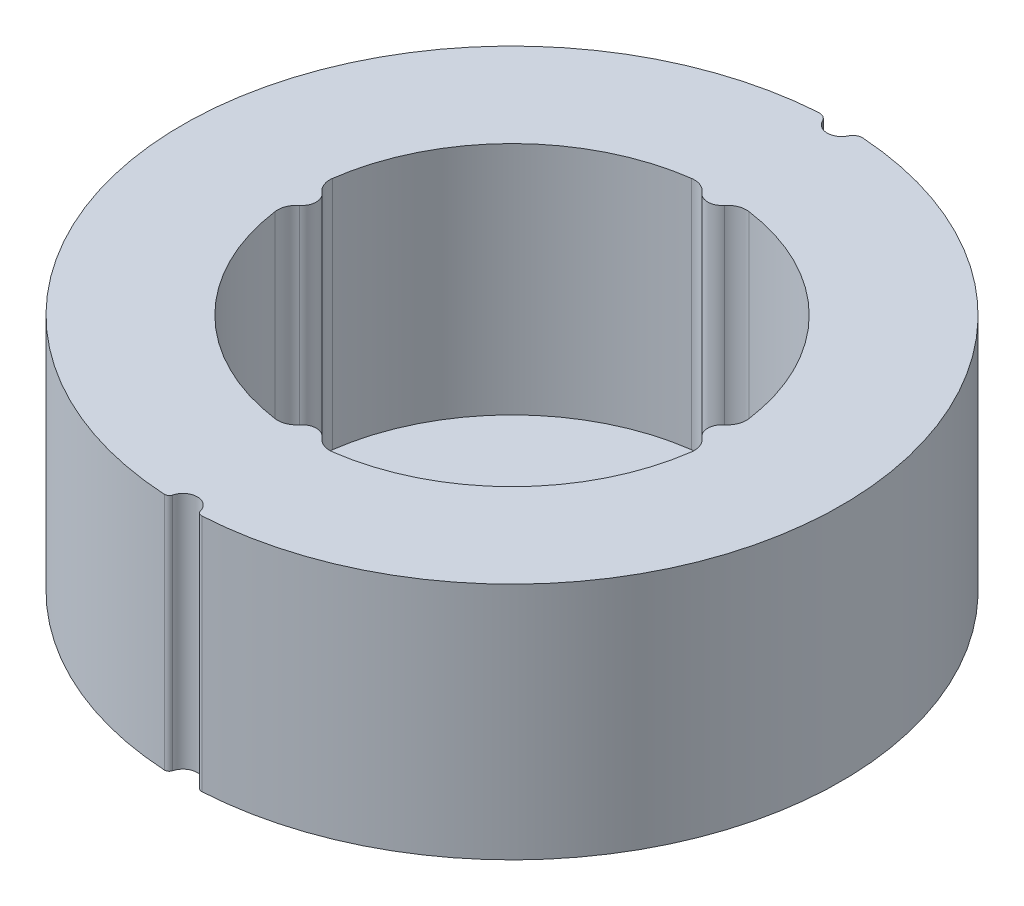
ISO-10303-21;
HEADER;
FILE_DESCRIPTION(('STEP AP214'),'2;1');
FILE_NAME('part.step','',(''),(''),'','','');
FILE_SCHEMA(('AUTOMOTIVE_DESIGN { 1 0 10303 214 1 1 1 1 }'));
ENDSEC;
DATA;
#1=APPLICATION_CONTEXT('core data for automotive mechanical design processes');
#2=APPLICATION_PROTOCOL_DEFINITION('international standard','automotive_design',2000,#1);
#3=PRODUCT_CONTEXT('',#1,'mechanical');
#4=PRODUCT('Part','Part','',(#3));
#5=PRODUCT_RELATED_PRODUCT_CATEGORY('part','',(#4));
#6=PRODUCT_DEFINITION_FORMATION('','',#4);
#7=PRODUCT_DEFINITION_CONTEXT('part definition',#1,'design');
#8=PRODUCT_DEFINITION('design','',#6,#7);
#9=PRODUCT_DEFINITION_SHAPE('','',#8);
#10=(LENGTH_UNIT() NAMED_UNIT(*) SI_UNIT(.MILLI.,.METRE.));
#11=(NAMED_UNIT(*) PLANE_ANGLE_UNIT() SI_UNIT($,.RADIAN.));
#12=(NAMED_UNIT(*) SI_UNIT($,.STERADIAN.) SOLID_ANGLE_UNIT());
#13=UNCERTAINTY_MEASURE_WITH_UNIT(LENGTH_MEASURE(1.E-05),#10,'distance_accuracy_value','');
#14=(GEOMETRIC_REPRESENTATION_CONTEXT(3) GLOBAL_UNCERTAINTY_ASSIGNED_CONTEXT((#13)) GLOBAL_UNIT_ASSIGNED_CONTEXT((#10,
#11,#12)) REPRESENTATION_CONTEXT('',''));
#15=CARTESIAN_POINT('',(0.,0.,0.));
#16=DIRECTION('',(0.,0.,1.));
#17=DIRECTION('',(1.,0.,0.));
#18=AXIS2_PLACEMENT_3D('',#15,#16,#17);
#19=CARTESIAN_POINT('',(0.,25.,0.));
#20=DIRECTION('',(0.,1.,0.));
#21=DIRECTION('',(0.,0.,1.));
#22=AXIS2_PLACEMENT_3D('',#19,#20,#21);
#23=PLANE('',#22);
#24=CARTESIAN_POINT('',(-1.93575856721061,25.,33.9428491683965));
#25=DIRECTION('',(0.,1.,0.));
#26=DIRECTION('',(0.,0.,1.));
#27=AXIS2_PLACEMENT_3D('',#24,#25,#26);
#28=CIRCLE('',#27,0.500000000000003);
#29=CARTESIAN_POINT('',(-1.45181892540796,25.,34.0685568574689));
#30=VERTEX_POINT('',#29);
#31=CARTESIAN_POINT('',(-1.96422560496371,25.,34.4420381383884));
#32=VERTEX_POINT('',#31);
#33=EDGE_CURVE('E338',#30,#32,#28,.F.);
#34=ORIENTED_EDGE('',*,*,#33,.F.);
#35=CARTESIAN_POINT('',(0.,25.,34.4456799246862));
#36=DIRECTION('',(0.,1.,0.));
#37=DIRECTION('',(0.,0.,1.));
#38=AXIS2_PLACEMENT_3D('',#35,#36,#37);
#39=CIRCLE('',#38,1.50000000000002);
#40=CARTESIAN_POINT('',(1.45181892540796,25.,34.0685568574689));
#41=VERTEX_POINT('',#40);
#42=EDGE_CURVE('E342',#41,#30,#39,.T.);
#43=ORIENTED_EDGE('',*,*,#42,.F.);
#44=CARTESIAN_POINT('',(1.93575856721061,25.,33.9428491683965));
#45=DIRECTION('',(0.,1.,0.));
#46=DIRECTION('',(0.,0.,1.));
#47=AXIS2_PLACEMENT_3D('',#44,#45,#46);
#48=CIRCLE('',#47,0.500000000000003);
#49=CARTESIAN_POINT('',(1.9642256049637,25.,34.4420381383884));
#50=VERTEX_POINT('',#49);
#51=EDGE_CURVE('E347',#41,#50,#48,.T.);
#52=ORIENTED_EDGE('',*,*,#51,.T.);
#53=CARTESIAN_POINT('',(0.,25.,-0.0020007910519898));
#54=DIRECTION('',(0.,1.,0.));
#55=DIRECTION('',(0.,0.,1.));
#56=AXIS2_PLACEMENT_3D('',#53,#54,#55);
#57=CIRCLE('',#56,34.5);
#58=CARTESIAN_POINT('',(2.32413582105506,25.,-34.4236276074198));
#59=VERTEX_POINT('',#58);
#60=EDGE_CURVE('E350',#50,#59,#57,.T.);
#61=ORIENTED_EDGE('',*,*,#60,.T.);
#62=CARTESIAN_POINT('',(2.2567695653723,25.,-33.4258992939019));
#63=DIRECTION('',(0.,1.,0.));
#64=DIRECTION('',(0.,0.,1.));
#65=AXIS2_PLACEMENT_3D('',#62,#63,#64);
#66=CIRCLE('',#65,1.);
#67=CARTESIAN_POINT('',(1.35406173922335,25.,-33.8561533823304));
#68=VERTEX_POINT('',#67);
#69=EDGE_CURVE('E353',#68,#59,#66,.F.);
#70=ORIENTED_EDGE('',*,*,#69,.F.);
#71=CARTESIAN_POINT('',(0.,25.,-34.5015345149731));
#72=DIRECTION('',(0.,1.,0.));
#73=DIRECTION('',(0.,0.,1.));
#74=AXIS2_PLACEMENT_3D('',#71,#72,#73);
#75=CIRCLE('',#74,1.49999999999991);
#76=CARTESIAN_POINT('',(-1.35406173922335,25.,-33.8561533823304));
#77=VERTEX_POINT('',#76);
#78=EDGE_CURVE('E357',#77,#68,#75,.T.);
#79=ORIENTED_EDGE('',*,*,#78,.F.);
#80=CARTESIAN_POINT('',(-2.2567695653723,25.,-33.4258992939019));
#81=DIRECTION('',(0.,1.,0.));
#82=DIRECTION('',(0.,0.,1.));
#83=AXIS2_PLACEMENT_3D('',#80,#81,#82);
#84=CIRCLE('',#83,1.);
#85=CARTESIAN_POINT('',(-2.32413582105505,25.,-34.4236276074198));
#86=VERTEX_POINT('',#85);
#87=EDGE_CURVE('E361',#77,#86,#84,.T.);
#88=ORIENTED_EDGE('',*,*,#87,.T.);
#89=CARTESIAN_POINT('',(0.,25.,-0.0020007910519898));
#90=DIRECTION('',(0.,1.,0.));
#91=DIRECTION('',(0.,0.,1.));
#92=AXIS2_PLACEMENT_3D('',#89,#90,#91);
#93=CIRCLE('',#92,34.5);
#94=EDGE_CURVE('E364',#86,#32,#93,.T.);
#95=ORIENTED_EDGE('',*,*,#94,.T.);
#96=EDGE_LOOP('',(#34,#43,#52,#61,#70,#79,#88,#95));
#97=FACE_BOUND('',#96,.T.);
#98=CARTESIAN_POINT('',(0.,25.,0.));
#99=DIRECTION('',(0.,1.,0.));
#100=DIRECTION('',(0.,0.,1.));
#101=AXIS2_PLACEMENT_3D('',#98,#99,#100);
#102=CIRCLE('',#101,22.);
#103=CARTESIAN_POINT('',(-21.79375,25.,3.00540528672926));
#104=VERTEX_POINT('',#103);
#105=CARTESIAN_POINT('',(-3.00540528672923,25.,21.79375));
#106=VERTEX_POINT('',#105);
#107=EDGE_CURVE('E233',#104,#106,#102,.T.);
#108=ORIENTED_EDGE('',*,*,#107,.F.);
#109=CARTESIAN_POINT('',(-19.8125,25.,2.73218662429934));
#110=DIRECTION('',(0.,1.,0.));
#111=DIRECTION('',(0.,0.,1.));
#112=AXIS2_PLACEMENT_3D('',#109,#110,#111);
#113=CIRCLE('',#112,2.);
#114=CARTESIAN_POINT('',(-21.0625,25.,1.17093712469974));
#115=VERTEX_POINT('',#114);
#116=EDGE_CURVE('E229',#115,#104,#113,.T.);
#117=ORIENTED_EDGE('',*,*,#116,.F.);
#118=CARTESIAN_POINT('',(-22.,25.,0.));
#119=DIRECTION('',(0.,-1.,0.));
#120=DIRECTION('',(0.,0.,1.));
#121=AXIS2_PLACEMENT_3D('',#118,#119,#120);
#122=CIRCLE('',#121,1.50000000000004);
#123=CARTESIAN_POINT('',(-21.0625,25.,-1.17093712469974));
#124=VERTEX_POINT('',#123);
#125=EDGE_CURVE('E211',#124,#115,#122,.T.);
#126=ORIENTED_EDGE('',*,*,#125,.F.);
#127=CARTESIAN_POINT('',(-19.8125,25.,-2.73218662429934));
#128=DIRECTION('',(0.,1.,0.));
#129=DIRECTION('',(0.,0.,-1.));
#130=AXIS2_PLACEMENT_3D('',#127,#128,#129);
#131=CIRCLE('',#130,2.);
#132=CARTESIAN_POINT('',(-21.79375,25.,-3.00540528672928));
#133=VERTEX_POINT('',#132);
#134=EDGE_CURVE('E277',#133,#124,#131,.T.);
#135=ORIENTED_EDGE('',*,*,#134,.F.);
#136=CARTESIAN_POINT('',(0.,25.,0.));
#137=DIRECTION('',(0.,1.,0.));
#138=DIRECTION('',(0.,0.,1.));
#139=AXIS2_PLACEMENT_3D('',#136,#137,#138);
#140=CIRCLE('',#139,22.);
#141=CARTESIAN_POINT('',(-3.00540528672923,25.,-21.79375));
#142=VERTEX_POINT('',#141);
#143=EDGE_CURVE('E274',#142,#133,#140,.T.);
#144=ORIENTED_EDGE('',*,*,#143,.F.);
#145=CARTESIAN_POINT('',(-2.7321866242993,25.,-19.8125));
#146=DIRECTION('',(0.,1.,0.));
#147=DIRECTION('',(0.,0.,1.));
#148=AXIS2_PLACEMENT_3D('',#145,#146,#147);
#149=CIRCLE('',#148,2.);
#150=CARTESIAN_POINT('',(-1.1709371246997,25.,-21.0625));
#151=VERTEX_POINT('',#150);
#152=EDGE_CURVE('E271',#151,#142,#149,.T.);
#153=ORIENTED_EDGE('',*,*,#152,.F.);
#154=CARTESIAN_POINT('',(0.,25.,-22.));
#155=DIRECTION('',(0.,-1.,0.));
#156=DIRECTION('',(0.,0.,1.));
#157=AXIS2_PLACEMENT_3D('',#154,#155,#156);
#158=CIRCLE('',#157,1.5);
#159=CARTESIAN_POINT('',(1.1709371246997,25.,-21.0625));
#160=VERTEX_POINT('',#159);
#161=EDGE_CURVE('E268',#160,#151,#158,.T.);
#162=ORIENTED_EDGE('',*,*,#161,.F.);
#163=CARTESIAN_POINT('',(2.7321866242993,25.,-19.8125));
#164=DIRECTION('',(0.,1.,0.));
#165=DIRECTION('',(0.,0.,-1.));
#166=AXIS2_PLACEMENT_3D('',#163,#164,#165);
#167=CIRCLE('',#166,2.);
#168=CARTESIAN_POINT('',(3.00540528672923,25.,-21.79375));
#169=VERTEX_POINT('',#168);
#170=EDGE_CURVE('E265',#169,#160,#167,.T.);
#171=ORIENTED_EDGE('',*,*,#170,.F.);
#172=CARTESIAN_POINT('',(0.,25.,0.));
#173=DIRECTION('',(0.,1.,0.));
#174=DIRECTION('',(0.,0.,1.));
#175=AXIS2_PLACEMENT_3D('',#172,#173,#174);
#176=CIRCLE('',#175,22.);
#177=CARTESIAN_POINT('',(21.79375,25.,-3.00540528672923));
#178=VERTEX_POINT('',#177);
#179=EDGE_CURVE('E262',#178,#169,#176,.T.);
#180=ORIENTED_EDGE('',*,*,#179,.F.);
#181=CARTESIAN_POINT('',(19.8125,25.,-2.7321866242993));
#182=DIRECTION('',(0.,1.,0.));
#183=DIRECTION('',(0.,0.,1.));
#184=AXIS2_PLACEMENT_3D('',#181,#182,#183);
#185=CIRCLE('',#184,2.);
#186=CARTESIAN_POINT('',(21.0625,25.,-1.1709371246997));
#187=VERTEX_POINT('',#186);
#188=EDGE_CURVE('E259',#187,#178,#185,.T.);
#189=ORIENTED_EDGE('',*,*,#188,.F.);
#190=CARTESIAN_POINT('',(22.,25.,0.));
#191=DIRECTION('',(0.,-1.,0.));
#192=DIRECTION('',(0.,0.,1.));
#193=AXIS2_PLACEMENT_3D('',#190,#191,#192);
#194=CIRCLE('',#193,1.5);
#195=CARTESIAN_POINT('',(21.0625,25.,1.1709371246997));
#196=VERTEX_POINT('',#195);
#197=EDGE_CURVE('E256',#196,#187,#194,.T.);
#198=ORIENTED_EDGE('',*,*,#197,.F.);
#199=CARTESIAN_POINT('',(19.8125,25.,2.7321866242993));
#200=DIRECTION('',(0.,1.,0.));
#201=DIRECTION('',(0.,0.,-1.));
#202=AXIS2_PLACEMENT_3D('',#199,#200,#201);
#203=CIRCLE('',#202,2.);
#204=CARTESIAN_POINT('',(21.79375,25.,3.00540528672923));
#205=VERTEX_POINT('',#204);
#206=EDGE_CURVE('E253',#205,#196,#203,.T.);
#207=ORIENTED_EDGE('',*,*,#206,.F.);
#208=CARTESIAN_POINT('',(0.,25.,0.));
#209=DIRECTION('',(0.,1.,0.));
#210=DIRECTION('',(0.,0.,1.));
#211=AXIS2_PLACEMENT_3D('',#208,#209,#210);
#212=CIRCLE('',#211,22.);
#213=CARTESIAN_POINT('',(3.00540528672923,25.,21.79375));
#214=VERTEX_POINT('',#213);
#215=EDGE_CURVE('E250',#214,#205,#212,.T.);
#216=ORIENTED_EDGE('',*,*,#215,.F.);
#217=CARTESIAN_POINT('',(2.7321866242993,25.,19.8125));
#218=DIRECTION('',(0.,1.,0.));
#219=DIRECTION('',(0.,0.,1.));
#220=AXIS2_PLACEMENT_3D('',#217,#218,#219);
#221=CIRCLE('',#220,2.);
#222=CARTESIAN_POINT('',(1.1709371246997,25.,21.0625));
#223=VERTEX_POINT('',#222);
#224=EDGE_CURVE('E247',#223,#214,#221,.T.);
#225=ORIENTED_EDGE('',*,*,#224,.F.);
#226=CARTESIAN_POINT('',(0.,25.,22.));
#227=DIRECTION('',(0.,-1.,0.));
#228=DIRECTION('',(0.,0.,1.));
#229=AXIS2_PLACEMENT_3D('',#226,#227,#228);
#230=CIRCLE('',#229,1.5);
#231=CARTESIAN_POINT('',(-1.1709371246997,25.,21.0625));
#232=VERTEX_POINT('',#231);
#233=EDGE_CURVE('E244',#232,#223,#230,.T.);
#234=ORIENTED_EDGE('',*,*,#233,.F.);
#235=CARTESIAN_POINT('',(-2.7321866242993,25.,19.8125));
#236=DIRECTION('',(0.,1.,0.));
#237=DIRECTION('',(0.,0.,-1.));
#238=AXIS2_PLACEMENT_3D('',#235,#236,#237);
#239=CIRCLE('',#238,2.);
#240=EDGE_CURVE('E241',#106,#232,#239,.T.);
#241=ORIENTED_EDGE('',*,*,#240,.F.);
#242=EDGE_LOOP('',(#108,#117,#126,#135,#144,#153,#162,#171,#180,#189,#198,#207,#216,#225,#234,#241));
#243=FACE_BOUND('',#242,.T.);
#244=ADVANCED_FACE('F41',(#97,#243),#23,.T.);
#245=CARTESIAN_POINT('',(0.,0.,0.));
#246=DIRECTION('',(0.,1.,0.));
#247=DIRECTION('',(0.,0.,1.));
#248=AXIS2_PLACEMENT_3D('',#245,#246,#247);
#249=PLANE('',#248);
#250=CARTESIAN_POINT('',(-1.93575856721061,0.,33.9428491683965));
#251=DIRECTION('',(0.,1.,0.));
#252=DIRECTION('',(0.,0.,1.));
#253=AXIS2_PLACEMENT_3D('',#250,#251,#252);
#254=CIRCLE('',#253,0.500000000000003);
#255=CARTESIAN_POINT('',(-1.45181892540796,0.,34.0685568574689));
#256=VERTEX_POINT('',#255);
#257=CARTESIAN_POINT('',(-1.96422560496371,0.,34.4420381383884));
#258=VERTEX_POINT('',#257);
#259=EDGE_CURVE('E337',#256,#258,#254,.F.);
#260=ORIENTED_EDGE('',*,*,#259,.T.);
#261=CARTESIAN_POINT('',(0.,0.,-0.0020007910519898));
#262=DIRECTION('',(0.,1.,0.));
#263=DIRECTION('',(0.,0.,1.));
#264=AXIS2_PLACEMENT_3D('',#261,#262,#263);
#265=CIRCLE('',#264,34.5);
#266=CARTESIAN_POINT('',(-2.32413582105505,0.,-34.4236276074198));
#267=VERTEX_POINT('',#266);
#268=EDGE_CURVE('E343',#267,#258,#265,.T.);
#269=ORIENTED_EDGE('',*,*,#268,.F.);
#270=CARTESIAN_POINT('',(-2.2567695653723,0.,-33.4258992939019));
#271=DIRECTION('',(0.,1.,0.));
#272=DIRECTION('',(0.,0.,1.));
#273=AXIS2_PLACEMENT_3D('',#270,#271,#272);
#274=CIRCLE('',#273,1.);
#275=CARTESIAN_POINT('',(-1.35406173922335,0.,-33.8561533823304));
#276=VERTEX_POINT('',#275);
#277=EDGE_CURVE('E390',#276,#267,#274,.T.);
#278=ORIENTED_EDGE('',*,*,#277,.F.);
#279=CARTESIAN_POINT('',(0.,0.,-34.5015345149731));
#280=DIRECTION('',(0.,1.,0.));
#281=DIRECTION('',(0.,0.,1.));
#282=AXIS2_PLACEMENT_3D('',#279,#280,#281);
#283=CIRCLE('',#282,1.49999999999991);
#284=CARTESIAN_POINT('',(1.35406173922335,0.,-33.8561533823304));
#285=VERTEX_POINT('',#284);
#286=EDGE_CURVE('E386',#276,#285,#283,.T.);
#287=ORIENTED_EDGE('',*,*,#286,.T.);
#288=CARTESIAN_POINT('',(2.2567695653723,0.,-33.4258992939019));
#289=DIRECTION('',(0.,1.,0.));
#290=DIRECTION('',(0.,0.,1.));
#291=AXIS2_PLACEMENT_3D('',#288,#289,#290);
#292=CIRCLE('',#291,1.);
#293=CARTESIAN_POINT('',(2.32413582105506,0.,-34.4236276074198));
#294=VERTEX_POINT('',#293);
#295=EDGE_CURVE('E382',#285,#294,#292,.F.);
#296=ORIENTED_EDGE('',*,*,#295,.T.);
#297=CARTESIAN_POINT('',(0.,0.,-0.0020007910519898));
#298=DIRECTION('',(0.,1.,0.));
#299=DIRECTION('',(0.,0.,1.));
#300=AXIS2_PLACEMENT_3D('',#297,#298,#299);
#301=CIRCLE('',#300,34.5);
#302=CARTESIAN_POINT('',(1.9642256049637,0.,34.4420381383884));
#303=VERTEX_POINT('',#302);
#304=EDGE_CURVE('E378',#303,#294,#301,.T.);
#305=ORIENTED_EDGE('',*,*,#304,.F.);
#306=CARTESIAN_POINT('',(1.93575856721061,0.,33.9428491683965));
#307=DIRECTION('',(0.,1.,0.));
#308=DIRECTION('',(0.,0.,1.));
#309=AXIS2_PLACEMENT_3D('',#306,#307,#308);
#310=CIRCLE('',#309,0.500000000000003);
#311=CARTESIAN_POINT('',(1.45181892540796,0.,34.0685568574689));
#312=VERTEX_POINT('',#311);
#313=EDGE_CURVE('E375',#312,#303,#310,.T.);
#314=ORIENTED_EDGE('',*,*,#313,.F.);
#315=CARTESIAN_POINT('',(0.,0.,34.4456799246862));
#316=DIRECTION('',(0.,1.,0.));
#317=DIRECTION('',(0.,0.,1.));
#318=AXIS2_PLACEMENT_3D('',#315,#316,#317);
#319=CIRCLE('',#318,1.50000000000002);
#320=EDGE_CURVE('E371',#312,#256,#319,.T.);
#321=ORIENTED_EDGE('',*,*,#320,.T.);
#322=EDGE_LOOP('',(#260,#269,#278,#287,#296,#305,#314,#321));
#323=FACE_BOUND('',#322,.T.);
#324=ADVANCED_FACE('F425',(#323),#249,.F.);
#325=CARTESIAN_POINT('',(-1.93575856721061,25.,33.9428491683965));
#326=DIRECTION('',(0.,-1.,0.));
#327=DIRECTION('',(0.,0.,-1.));
#328=AXIS2_PLACEMENT_3D('',#325,#326,#327);
#329=CYLINDRICAL_SURFACE('',#328,0.500000000000003);
#330=ORIENTED_EDGE('',*,*,#259,.F.);
#331=DIRECTION('',(0.,-1.,0.));
#332=VECTOR('',#331,1.);
#333=CARTESIAN_POINT('',(-1.45181892540796,25.,34.0685568574689));
#334=LINE('',#333,#332);
#335=EDGE_CURVE('E11',#30,#256,#334,.T.);
#336=ORIENTED_EDGE('',*,*,#335,.F.);
#337=ORIENTED_EDGE('',*,*,#33,.T.);
#338=DIRECTION('',(0.,-1.,0.));
#339=VECTOR('',#338,1.);
#340=CARTESIAN_POINT('',(-1.96422560496371,25.,34.4420381383884));
#341=LINE('',#340,#339);
#342=EDGE_CURVE('E367',#32,#258,#341,.T.);
#343=ORIENTED_EDGE('',*,*,#342,.T.);
#344=EDGE_LOOP('',(#330,#336,#337,#343));
#345=FACE_BOUND('',#344,.T.);
#346=ADVANCED_FACE('F43',(#345),#329,.T.);
#347=CARTESIAN_POINT('',(0.,25.,34.4456799246862));
#348=DIRECTION('',(0.,-1.,0.));
#349=DIRECTION('',(0.,0.,-1.));
#350=AXIS2_PLACEMENT_3D('',#347,#348,#349);
#351=CYLINDRICAL_SURFACE('',#350,1.50000000000002);
#352=ORIENTED_EDGE('',*,*,#320,.F.);
#353=DIRECTION('',(0.,-1.,0.));
#354=VECTOR('',#353,1.);
#355=CARTESIAN_POINT('',(1.45181892540796,25.,34.0685568574689));
#356=LINE('',#355,#354);
#357=EDGE_CURVE('E50',#41,#312,#356,.T.);
#358=ORIENTED_EDGE('',*,*,#357,.F.);
#359=ORIENTED_EDGE('',*,*,#42,.T.);
#360=ORIENTED_EDGE('',*,*,#335,.T.);
#361=EDGE_LOOP('',(#352,#358,#359,#360));
#362=FACE_BOUND('',#361,.T.);
#363=ADVANCED_FACE('F426',(#362),#351,.F.);
#364=CARTESIAN_POINT('',(1.93575856721061,25.,33.9428491683965));
#365=DIRECTION('',(0.,-1.,0.));
#366=DIRECTION('',(0.,0.,-1.));
#367=AXIS2_PLACEMENT_3D('',#364,#365,#366);
#368=CYLINDRICAL_SURFACE('',#367,0.500000000000003);
#369=ORIENTED_EDGE('',*,*,#313,.T.);
#370=DIRECTION('',(0.,-1.,0.));
#371=VECTOR('',#370,1.);
#372=CARTESIAN_POINT('',(1.9642256049637,25.,34.4420381383884));
#373=LINE('',#372,#371);
#374=EDGE_CURVE('E411',#50,#303,#373,.T.);
#375=ORIENTED_EDGE('',*,*,#374,.F.);
#376=ORIENTED_EDGE('',*,*,#51,.F.);
#377=ORIENTED_EDGE('',*,*,#357,.T.);
#378=EDGE_LOOP('',(#369,#375,#376,#377));
#379=FACE_BOUND('',#378,.T.);
#380=ADVANCED_FACE('F418',(#379),#368,.T.);
#381=CARTESIAN_POINT('',(0.,25.,-0.0020007910519898));
#382=DIRECTION('',(0.,-1.,0.));
#383=DIRECTION('',(0.,0.,-1.));
#384=AXIS2_PLACEMENT_3D('',#381,#382,#383);
#385=CYLINDRICAL_SURFACE('',#384,34.5);
#386=ORIENTED_EDGE('',*,*,#304,.T.);
#387=DIRECTION('',(0.,-1.,0.));
#388=VECTOR('',#387,1.);
#389=CARTESIAN_POINT('',(2.32413582105506,25.,-34.4236276074198));
#390=LINE('',#389,#388);
#391=EDGE_CURVE('E408',#59,#294,#390,.T.);
#392=ORIENTED_EDGE('',*,*,#391,.F.);
#393=ORIENTED_EDGE('',*,*,#60,.F.);
#394=ORIENTED_EDGE('',*,*,#374,.T.);
#395=EDGE_LOOP('',(#386,#392,#393,#394));
#396=FACE_BOUND('',#395,.T.);
#397=ADVANCED_FACE('F451',(#396),#385,.T.);
#398=CARTESIAN_POINT('',(2.2567695653723,25.,-33.4258992939019));
#399=DIRECTION('',(0.,-1.,0.));
#400=DIRECTION('',(0.,0.,-1.));
#401=AXIS2_PLACEMENT_3D('',#398,#399,#400);
#402=CYLINDRICAL_SURFACE('',#401,1.);
#403=ORIENTED_EDGE('',*,*,#295,.F.);
#404=DIRECTION('',(0.,-1.,0.));
#405=VECTOR('',#404,1.);
#406=CARTESIAN_POINT('',(1.35406173922335,25.,-33.8561533823304));
#407=LINE('',#406,#405);
#408=EDGE_CURVE('E405',#68,#285,#407,.T.);
#409=ORIENTED_EDGE('',*,*,#408,.F.);
#410=ORIENTED_EDGE('',*,*,#69,.T.);
#411=ORIENTED_EDGE('',*,*,#391,.T.);
#412=EDGE_LOOP('',(#403,#409,#410,#411));
#413=FACE_BOUND('',#412,.T.);
#414=ADVANCED_FACE('F446',(#413),#402,.T.);
#415=CARTESIAN_POINT('',(0.,25.,-34.5015345149731));
#416=DIRECTION('',(0.,-1.,0.));
#417=DIRECTION('',(0.,0.,-1.));
#418=AXIS2_PLACEMENT_3D('',#415,#416,#417);
#419=CYLINDRICAL_SURFACE('',#418,1.49999999999991);
#420=ORIENTED_EDGE('',*,*,#286,.F.);
#421=DIRECTION('',(0.,-1.,0.));
#422=VECTOR('',#421,1.);
#423=CARTESIAN_POINT('',(-1.35406173922335,25.,-33.8561533823304));
#424=LINE('',#423,#422);
#425=EDGE_CURVE('E402',#77,#276,#424,.T.);
#426=ORIENTED_EDGE('',*,*,#425,.F.);
#427=ORIENTED_EDGE('',*,*,#78,.T.);
#428=ORIENTED_EDGE('',*,*,#408,.T.);
#429=EDGE_LOOP('',(#420,#426,#427,#428));
#430=FACE_BOUND('',#429,.T.);
#431=ADVANCED_FACE('F443',(#430),#419,.F.);
#432=CARTESIAN_POINT('',(-2.2567695653723,25.,-33.4258992939019));
#433=DIRECTION('',(0.,-1.,0.));
#434=DIRECTION('',(0.,0.,-1.));
#435=AXIS2_PLACEMENT_3D('',#432,#433,#434);
#436=CYLINDRICAL_SURFACE('',#435,1.);
#437=ORIENTED_EDGE('',*,*,#277,.T.);
#438=DIRECTION('',(0.,-1.,0.));
#439=VECTOR('',#438,1.);
#440=CARTESIAN_POINT('',(-2.32413582105505,25.,-34.4236276074198));
#441=LINE('',#440,#439);
#442=EDGE_CURVE('E398',#86,#267,#441,.T.);
#443=ORIENTED_EDGE('',*,*,#442,.F.);
#444=ORIENTED_EDGE('',*,*,#87,.F.);
#445=ORIENTED_EDGE('',*,*,#425,.T.);
#446=EDGE_LOOP('',(#437,#443,#444,#445));
#447=FACE_BOUND('',#446,.T.);
#448=ADVANCED_FACE('F440',(#447),#436,.T.);
#449=CARTESIAN_POINT('',(0.,25.,-0.0020007910519898));
#450=DIRECTION('',(0.,-1.,0.));
#451=DIRECTION('',(0.,0.,-1.));
#452=AXIS2_PLACEMENT_3D('',#449,#450,#451);
#453=CYLINDRICAL_SURFACE('',#452,34.5);
#454=ORIENTED_EDGE('',*,*,#268,.T.);
#455=ORIENTED_EDGE('',*,*,#342,.F.);
#456=ORIENTED_EDGE('',*,*,#94,.F.);
#457=ORIENTED_EDGE('',*,*,#442,.T.);
#458=EDGE_LOOP('',(#454,#455,#456,#457));
#459=FACE_BOUND('',#458,.T.);
#460=ADVANCED_FACE('F435',(#459),#453,.T.);
#461=CARTESIAN_POINT('',(-19.8125,25.,2.73218662429934));
#462=DIRECTION('',(0.,-1.,0.));
#463=DIRECTION('',(0.,0.,-1.));
#464=AXIS2_PLACEMENT_3D('',#461,#462,#463);
#465=CYLINDRICAL_SURFACE('',#464,2.);
#466=CARTESIAN_POINT('',(-19.8125,0.4,2.73218662429934));
#467=DIRECTION('',(0.,1.,0.));
#468=DIRECTION('',(0.,0.,1.));
#469=AXIS2_PLACEMENT_3D('',#466,#467,#468);
#470=CIRCLE('',#469,2.);
#471=CARTESIAN_POINT('',(-21.0625,0.4,1.17093712469974));
#472=VERTEX_POINT('',#471);
#473=CARTESIAN_POINT('',(-21.79375,0.400000000000001,3.00540528672926));
#474=VERTEX_POINT('',#473);
#475=EDGE_CURVE('E218',#472,#474,#470,.T.);
#476=ORIENTED_EDGE('',*,*,#475,.F.);
#477=DIRECTION('',(0.,-1.,0.));
#478=VECTOR('',#477,1.);
#479=CARTESIAN_POINT('',(-21.0625,25.,1.17093712469974));
#480=LINE('',#479,#478);
#481=EDGE_CURVE('E204',#115,#472,#480,.T.);
#482=ORIENTED_EDGE('',*,*,#481,.F.);
#483=ORIENTED_EDGE('',*,*,#116,.T.);
#484=DIRECTION('',(0.,-1.,0.));
#485=VECTOR('',#484,1.);
#486=CARTESIAN_POINT('',(-21.79375,25.,3.00540528672926));
#487=LINE('',#486,#485);
#488=EDGE_CURVE('E220',#104,#474,#487,.T.);
#489=ORIENTED_EDGE('',*,*,#488,.T.);
#490=EDGE_LOOP('',(#476,#482,#483,#489));
#491=FACE_BOUND('',#490,.T.);
#492=ADVANCED_FACE('F219',(#491),#465,.F.);
#493=CARTESIAN_POINT('',(0.,25.,0.));
#494=DIRECTION('',(0.,-1.,0.));
#495=DIRECTION('',(0.,0.,-1.));
#496=AXIS2_PLACEMENT_3D('',#493,#494,#495);
#497=CYLINDRICAL_SURFACE('',#496,22.);
#498=CARTESIAN_POINT('',(0.,0.4,0.));
#499=DIRECTION('',(0.,1.,0.));
#500=DIRECTION('',(0.,0.,1.));
#501=AXIS2_PLACEMENT_3D('',#498,#499,#500);
#502=CIRCLE('',#501,22.);
#503=CARTESIAN_POINT('',(-3.00540528672923,0.400000000000001,21.79375));
#504=VERTEX_POINT('',#503);
#505=EDGE_CURVE('E57',#474,#504,#502,.T.);
#506=ORIENTED_EDGE('',*,*,#505,.F.);
#507=ORIENTED_EDGE('',*,*,#488,.F.);
#508=ORIENTED_EDGE('',*,*,#107,.T.);
#509=DIRECTION('',(0.,-1.,0.));
#510=VECTOR('',#509,1.);
#511=CARTESIAN_POINT('',(-3.00540528672923,25.,21.79375));
#512=LINE('',#511,#510);
#513=EDGE_CURVE('E332',#106,#504,#512,.T.);
#514=ORIENTED_EDGE('',*,*,#513,.T.);
#515=EDGE_LOOP('',(#506,#507,#508,#514));
#516=FACE_BOUND('',#515,.T.);
#517=ADVANCED_FACE('F459',(#516),#497,.F.);
#518=CARTESIAN_POINT('',(-2.7321866242993,25.,19.8125));
#519=DIRECTION('',(0.,-1.,0.));
#520=DIRECTION('',(0.,0.,-1.));
#521=AXIS2_PLACEMENT_3D('',#518,#519,#520);
#522=CYLINDRICAL_SURFACE('',#521,2.);
#523=CARTESIAN_POINT('',(-2.7321866242993,0.4,19.8125));
#524=DIRECTION('',(0.,1.,0.));
#525=DIRECTION('',(0.,0.,-1.));
#526=AXIS2_PLACEMENT_3D('',#523,#524,#525);
#527=CIRCLE('',#526,2.);
#528=CARTESIAN_POINT('',(-1.1709371246997,0.400000000000001,21.0625));
#529=VERTEX_POINT('',#528);
#530=EDGE_CURVE('E65',#504,#529,#527,.T.);
#531=ORIENTED_EDGE('',*,*,#530,.F.);
#532=ORIENTED_EDGE('',*,*,#513,.F.);
#533=ORIENTED_EDGE('',*,*,#240,.T.);
#534=DIRECTION('',(0.,-1.,0.));
#535=VECTOR('',#534,1.);
#536=CARTESIAN_POINT('',(-1.1709371246997,25.,21.0625));
#537=LINE('',#536,#535);
#538=EDGE_CURVE('E329',#232,#529,#537,.T.);
#539=ORIENTED_EDGE('',*,*,#538,.T.);
#540=EDGE_LOOP('',(#531,#532,#533,#539));
#541=FACE_BOUND('',#540,.T.);
#542=ADVANCED_FACE('F460',(#541),#522,.F.);
#543=CARTESIAN_POINT('',(0.,25.,22.));
#544=DIRECTION('',(0.,-1.,0.));
#545=DIRECTION('',(0.,0.,-1.));
#546=AXIS2_PLACEMENT_3D('',#543,#544,#545);
#547=CYLINDRICAL_SURFACE('',#546,1.5);
#548=CARTESIAN_POINT('',(0.,0.4,22.));
#549=DIRECTION('',(0.,-1.,0.));
#550=DIRECTION('',(0.,0.,1.));
#551=AXIS2_PLACEMENT_3D('',#548,#549,#550);
#552=CIRCLE('',#551,1.5);
#553=CARTESIAN_POINT('',(1.1709371246997,0.400000000000001,21.0625));
#554=VERTEX_POINT('',#553);
#555=EDGE_CURVE('E466',#529,#554,#552,.T.);
#556=ORIENTED_EDGE('',*,*,#555,.F.);
#557=ORIENTED_EDGE('',*,*,#538,.F.);
#558=ORIENTED_EDGE('',*,*,#233,.T.);
#559=DIRECTION('',(0.,-1.,0.));
#560=VECTOR('',#559,1.);
#561=CARTESIAN_POINT('',(1.1709371246997,25.,21.0625));
#562=LINE('',#561,#560);
#563=EDGE_CURVE('E325',#223,#554,#562,.T.);
#564=ORIENTED_EDGE('',*,*,#563,.T.);
#565=EDGE_LOOP('',(#556,#557,#558,#564));
#566=FACE_BOUND('',#565,.T.);
#567=ADVANCED_FACE('F463',(#566),#547,.T.);
#568=CARTESIAN_POINT('',(2.7321866242993,25.,19.8125));
#569=DIRECTION('',(0.,-1.,0.));
#570=DIRECTION('',(0.,0.,-1.));
#571=AXIS2_PLACEMENT_3D('',#568,#569,#570);
#572=CYLINDRICAL_SURFACE('',#571,2.);
#573=CARTESIAN_POINT('',(2.7321866242993,0.4,19.8125));
#574=DIRECTION('',(0.,1.,0.));
#575=DIRECTION('',(0.,0.,1.));
#576=AXIS2_PLACEMENT_3D('',#573,#574,#575);
#577=CIRCLE('',#576,2.);
#578=CARTESIAN_POINT('',(3.00540528672923,0.400000000000001,21.79375));
#579=VERTEX_POINT('',#578);
#580=EDGE_CURVE('E482',#554,#579,#577,.T.);
#581=ORIENTED_EDGE('',*,*,#580,.F.);
#582=ORIENTED_EDGE('',*,*,#563,.F.);
#583=ORIENTED_EDGE('',*,*,#224,.T.);
#584=DIRECTION('',(0.,-1.,0.));
#585=VECTOR('',#584,1.);
#586=CARTESIAN_POINT('',(3.00540528672923,25.,21.79375));
#587=LINE('',#586,#585);
#588=EDGE_CURVE('E321',#214,#579,#587,.T.);
#589=ORIENTED_EDGE('',*,*,#588,.T.);
#590=EDGE_LOOP('',(#581,#582,#583,#589));
#591=FACE_BOUND('',#590,.T.);
#592=ADVANCED_FACE('F472',(#591),#572,.F.);
#593=CARTESIAN_POINT('',(0.,25.,0.));
#594=DIRECTION('',(0.,-1.,0.));
#595=DIRECTION('',(0.,0.,-1.));
#596=AXIS2_PLACEMENT_3D('',#593,#594,#595);
#597=CYLINDRICAL_SURFACE('',#596,22.);
#598=CARTESIAN_POINT('',(0.,0.4,0.));
#599=DIRECTION('',(0.,1.,0.));
#600=DIRECTION('',(0.,0.,1.));
#601=AXIS2_PLACEMENT_3D('',#598,#599,#600);
#602=CIRCLE('',#601,22.);
#603=CARTESIAN_POINT('',(21.79375,0.400000000000001,3.00540528672923));
#604=VERTEX_POINT('',#603);
#605=EDGE_CURVE('E478',#579,#604,#602,.T.);
#606=ORIENTED_EDGE('',*,*,#605,.F.);
#607=ORIENTED_EDGE('',*,*,#588,.F.);
#608=ORIENTED_EDGE('',*,*,#215,.T.);
#609=DIRECTION('',(0.,-1.,0.));
#610=VECTOR('',#609,1.);
#611=CARTESIAN_POINT('',(21.79375,25.,3.00540528672923));
#612=LINE('',#611,#610);
#613=EDGE_CURVE('E317',#205,#604,#612,.T.);
#614=ORIENTED_EDGE('',*,*,#613,.T.);
#615=EDGE_LOOP('',(#606,#607,#608,#614));
#616=FACE_BOUND('',#615,.T.);
#617=ADVANCED_FACE('F475',(#616),#597,.F.);
#618=CARTESIAN_POINT('',(19.8125,25.,2.7321866242993));
#619=DIRECTION('',(0.,-1.,0.));
#620=DIRECTION('',(0.,0.,-1.));
#621=AXIS2_PLACEMENT_3D('',#618,#619,#620);
#622=CYLINDRICAL_SURFACE('',#621,2.);
#623=CARTESIAN_POINT('',(19.8125,0.4,2.7321866242993));
#624=DIRECTION('',(0.,1.,0.));
#625=DIRECTION('',(0.,0.,-1.));
#626=AXIS2_PLACEMENT_3D('',#623,#624,#625);
#627=CIRCLE('',#626,2.);
#628=CARTESIAN_POINT('',(21.0625,0.400000000000001,1.1709371246997));
#629=VERTEX_POINT('',#628);
#630=EDGE_CURVE('E481',#604,#629,#627,.T.);
#631=ORIENTED_EDGE('',*,*,#630,.F.);
#632=ORIENTED_EDGE('',*,*,#613,.F.);
#633=ORIENTED_EDGE('',*,*,#206,.T.);
#634=DIRECTION('',(0.,-1.,0.));
#635=VECTOR('',#634,1.);
#636=CARTESIAN_POINT('',(21.0625,25.,1.1709371246997));
#637=LINE('',#636,#635);
#638=EDGE_CURVE('E313',#196,#629,#637,.T.);
#639=ORIENTED_EDGE('',*,*,#638,.T.);
#640=EDGE_LOOP('',(#631,#632,#633,#639));
#641=FACE_BOUND('',#640,.T.);
#642=ADVANCED_FACE('F559',(#641),#622,.F.);
#643=CARTESIAN_POINT('',(22.,25.,0.));
#644=DIRECTION('',(0.,-1.,0.));
#645=DIRECTION('',(0.,0.,-1.));
#646=AXIS2_PLACEMENT_3D('',#643,#644,#645);
#647=CYLINDRICAL_SURFACE('',#646,1.5);
#648=CARTESIAN_POINT('',(22.,0.4,0.));
#649=DIRECTION('',(0.,-1.,0.));
#650=DIRECTION('',(0.,0.,1.));
#651=AXIS2_PLACEMENT_3D('',#648,#649,#650);
#652=CIRCLE('',#651,1.5);
#653=CARTESIAN_POINT('',(21.0625,0.400000000000001,-1.1709371246997));
#654=VERTEX_POINT('',#653);
#655=EDGE_CURVE('E486',#629,#654,#652,.T.);
#656=ORIENTED_EDGE('',*,*,#655,.F.);
#657=ORIENTED_EDGE('',*,*,#638,.F.);
#658=ORIENTED_EDGE('',*,*,#197,.T.);
#659=DIRECTION('',(0.,-1.,0.));
#660=VECTOR('',#659,1.);
#661=CARTESIAN_POINT('',(21.0625,25.,-1.1709371246997));
#662=LINE('',#661,#660);
#663=EDGE_CURVE('E309',#187,#654,#662,.T.);
#664=ORIENTED_EDGE('',*,*,#663,.T.);
#665=EDGE_LOOP('',(#656,#657,#658,#664));
#666=FACE_BOUND('',#665,.T.);
#667=ADVANCED_FACE('F555',(#666),#647,.T.);
#668=CARTESIAN_POINT('',(19.8125,25.,-2.7321866242993));
#669=DIRECTION('',(0.,-1.,0.));
#670=DIRECTION('',(0.,0.,-1.));
#671=AXIS2_PLACEMENT_3D('',#668,#669,#670);
#672=CYLINDRICAL_SURFACE('',#671,2.);
#673=CARTESIAN_POINT('',(19.8125,0.4,-2.7321866242993));
#674=DIRECTION('',(0.,1.,0.));
#675=DIRECTION('',(0.,0.,1.));
#676=AXIS2_PLACEMENT_3D('',#673,#674,#675);
#677=CIRCLE('',#676,2.);
#678=CARTESIAN_POINT('',(21.79375,0.400000000000001,-3.00540528672923));
#679=VERTEX_POINT('',#678);
#680=EDGE_CURVE('E494',#654,#679,#677,.T.);
#681=ORIENTED_EDGE('',*,*,#680,.F.);
#682=ORIENTED_EDGE('',*,*,#663,.F.);
#683=ORIENTED_EDGE('',*,*,#188,.T.);
#684=DIRECTION('',(0.,-1.,0.));
#685=VECTOR('',#684,1.);
#686=CARTESIAN_POINT('',(21.79375,25.,-3.00540528672923));
#687=LINE('',#686,#685);
#688=EDGE_CURVE('E305',#178,#679,#687,.T.);
#689=ORIENTED_EDGE('',*,*,#688,.T.);
#690=EDGE_LOOP('',(#681,#682,#683,#689));
#691=FACE_BOUND('',#690,.T.);
#692=ADVANCED_FACE('F551',(#691),#672,.F.);
#693=CARTESIAN_POINT('',(0.,25.,0.));
#694=DIRECTION('',(0.,-1.,0.));
#695=DIRECTION('',(0.,0.,-1.));
#696=AXIS2_PLACEMENT_3D('',#693,#694,#695);
#697=CYLINDRICAL_SURFACE('',#696,22.);
#698=CARTESIAN_POINT('',(0.,0.4,0.));
#699=DIRECTION('',(0.,1.,0.));
#700=DIRECTION('',(0.,0.,1.));
#701=AXIS2_PLACEMENT_3D('',#698,#699,#700);
#702=CIRCLE('',#701,22.);
#703=CARTESIAN_POINT('',(3.00540528672923,0.400000000000001,-21.79375));
#704=VERTEX_POINT('',#703);
#705=EDGE_CURVE('E498',#679,#704,#702,.T.);
#706=ORIENTED_EDGE('',*,*,#705,.F.);
#707=ORIENTED_EDGE('',*,*,#688,.F.);
#708=ORIENTED_EDGE('',*,*,#179,.T.);
#709=DIRECTION('',(0.,-1.,0.));
#710=VECTOR('',#709,1.);
#711=CARTESIAN_POINT('',(3.00540528672923,25.,-21.79375));
#712=LINE('',#711,#710);
#713=EDGE_CURVE('E301',#169,#704,#712,.T.);
#714=ORIENTED_EDGE('',*,*,#713,.T.);
#715=EDGE_LOOP('',(#706,#707,#708,#714));
#716=FACE_BOUND('',#715,.T.);
#717=ADVANCED_FACE('F547',(#716),#697,.F.);
#718=CARTESIAN_POINT('',(2.7321866242993,25.,-19.8125));
#719=DIRECTION('',(0.,-1.,0.));
#720=DIRECTION('',(0.,0.,-1.));
#721=AXIS2_PLACEMENT_3D('',#718,#719,#720);
#722=CYLINDRICAL_SURFACE('',#721,2.);
#723=CARTESIAN_POINT('',(2.7321866242993,0.4,-19.8125));
#724=DIRECTION('',(0.,1.,0.));
#725=DIRECTION('',(0.,0.,-1.));
#726=AXIS2_PLACEMENT_3D('',#723,#724,#725);
#727=CIRCLE('',#726,2.);
#728=CARTESIAN_POINT('',(1.1709371246997,0.400000000000001,-21.0625));
#729=VERTEX_POINT('',#728);
#730=EDGE_CURVE('E502',#704,#729,#727,.T.);
#731=ORIENTED_EDGE('',*,*,#730,.F.);
#732=ORIENTED_EDGE('',*,*,#713,.F.);
#733=ORIENTED_EDGE('',*,*,#170,.T.);
#734=DIRECTION('',(0.,-1.,0.));
#735=VECTOR('',#734,1.);
#736=CARTESIAN_POINT('',(1.1709371246997,25.,-21.0625));
#737=LINE('',#736,#735);
#738=EDGE_CURVE('E297',#160,#729,#737,.T.);
#739=ORIENTED_EDGE('',*,*,#738,.T.);
#740=EDGE_LOOP('',(#731,#732,#733,#739));
#741=FACE_BOUND('',#740,.T.);
#742=ADVANCED_FACE('F543',(#741),#722,.F.);
#743=CARTESIAN_POINT('',(0.,25.,-22.));
#744=DIRECTION('',(0.,-1.,0.));
#745=DIRECTION('',(0.,0.,-1.));
#746=AXIS2_PLACEMENT_3D('',#743,#744,#745);
#747=CYLINDRICAL_SURFACE('',#746,1.5);
#748=CARTESIAN_POINT('',(0.,0.4,-22.));
#749=DIRECTION('',(0.,-1.,0.));
#750=DIRECTION('',(0.,0.,1.));
#751=AXIS2_PLACEMENT_3D('',#748,#749,#750);
#752=CIRCLE('',#751,1.5);
#753=CARTESIAN_POINT('',(-1.1709371246997,0.400000000000001,-21.0625));
#754=VERTEX_POINT('',#753);
#755=EDGE_CURVE('E506',#729,#754,#752,.T.);
#756=ORIENTED_EDGE('',*,*,#755,.F.);
#757=ORIENTED_EDGE('',*,*,#738,.F.);
#758=ORIENTED_EDGE('',*,*,#161,.T.);
#759=DIRECTION('',(0.,-1.,0.));
#760=VECTOR('',#759,1.);
#761=CARTESIAN_POINT('',(-1.1709371246997,25.,-21.0625));
#762=LINE('',#761,#760);
#763=EDGE_CURVE('E293',#151,#754,#762,.T.);
#764=ORIENTED_EDGE('',*,*,#763,.T.);
#765=EDGE_LOOP('',(#756,#757,#758,#764));
#766=FACE_BOUND('',#765,.T.);
#767=ADVANCED_FACE('F540',(#766),#747,.T.);
#768=CARTESIAN_POINT('',(-2.7321866242993,25.,-19.8125));
#769=DIRECTION('',(0.,-1.,0.));
#770=DIRECTION('',(0.,0.,-1.));
#771=AXIS2_PLACEMENT_3D('',#768,#769,#770);
#772=CYLINDRICAL_SURFACE('',#771,2.);
#773=CARTESIAN_POINT('',(-2.7321866242993,0.4,-19.8125));
#774=DIRECTION('',(0.,1.,0.));
#775=DIRECTION('',(0.,0.,1.));
#776=AXIS2_PLACEMENT_3D('',#773,#774,#775);
#777=CIRCLE('',#776,2.);
#778=CARTESIAN_POINT('',(-3.00540528672923,0.400000000000001,-21.79375));
#779=VERTEX_POINT('',#778);
#780=EDGE_CURVE('E510',#754,#779,#777,.T.);
#781=ORIENTED_EDGE('',*,*,#780,.F.);
#782=ORIENTED_EDGE('',*,*,#763,.F.);
#783=ORIENTED_EDGE('',*,*,#152,.T.);
#784=DIRECTION('',(0.,-1.,0.));
#785=VECTOR('',#784,1.);
#786=CARTESIAN_POINT('',(-3.00540528672923,25.,-21.79375));
#787=LINE('',#786,#785);
#788=EDGE_CURVE('E289',#142,#779,#787,.T.);
#789=ORIENTED_EDGE('',*,*,#788,.T.);
#790=EDGE_LOOP('',(#781,#782,#783,#789));
#791=FACE_BOUND('',#790,.T.);
#792=ADVANCED_FACE('F520',(#791),#772,.F.);
#793=CARTESIAN_POINT('',(0.,25.,0.));
#794=DIRECTION('',(0.,-1.,0.));
#795=DIRECTION('',(0.,0.,-1.));
#796=AXIS2_PLACEMENT_3D('',#793,#794,#795);
#797=CYLINDRICAL_SURFACE('',#796,22.);
#798=CARTESIAN_POINT('',(0.,0.4,0.));
#799=DIRECTION('',(0.,1.,0.));
#800=DIRECTION('',(0.,0.,1.));
#801=AXIS2_PLACEMENT_3D('',#798,#799,#800);
#802=CIRCLE('',#801,22.);
#803=CARTESIAN_POINT('',(-21.79375,0.400000000000001,-3.00540528672928));
#804=VERTEX_POINT('',#803);
#805=EDGE_CURVE('E235',#779,#804,#802,.T.);
#806=ORIENTED_EDGE('',*,*,#805,.F.);
#807=ORIENTED_EDGE('',*,*,#788,.F.);
#808=ORIENTED_EDGE('',*,*,#143,.T.);
#809=DIRECTION('',(0.,-1.,0.));
#810=VECTOR('',#809,1.);
#811=CARTESIAN_POINT('',(-21.79375,25.,-3.00540528672928));
#812=LINE('',#811,#810);
#813=EDGE_CURVE('E285',#133,#804,#812,.T.);
#814=ORIENTED_EDGE('',*,*,#813,.T.);
#815=EDGE_LOOP('',(#806,#807,#808,#814));
#816=FACE_BOUND('',#815,.T.);
#817=ADVANCED_FACE('F516',(#816),#797,.F.);
#818=CARTESIAN_POINT('',(-19.8125,25.,-2.73218662429934));
#819=DIRECTION('',(0.,-1.,0.));
#820=DIRECTION('',(0.,0.,-1.));
#821=AXIS2_PLACEMENT_3D('',#818,#819,#820);
#822=CYLINDRICAL_SURFACE('',#821,2.);
#823=CARTESIAN_POINT('',(-19.8125,0.4,-2.73218662429934));
#824=DIRECTION('',(0.,1.,0.));
#825=DIRECTION('',(0.,0.,-1.));
#826=AXIS2_PLACEMENT_3D('',#823,#824,#825);
#827=CIRCLE('',#826,2.);
#828=CARTESIAN_POINT('',(-21.0625,0.400000000000001,-1.17093712469974));
#829=VERTEX_POINT('',#828);
#830=EDGE_CURVE('E227',#804,#829,#827,.T.);
#831=ORIENTED_EDGE('',*,*,#830,.F.);
#832=ORIENTED_EDGE('',*,*,#813,.F.);
#833=ORIENTED_EDGE('',*,*,#134,.T.);
#834=DIRECTION('',(0.,-1.,0.));
#835=VECTOR('',#834,1.);
#836=CARTESIAN_POINT('',(-21.0625,25.,-1.17093712469974));
#837=LINE('',#836,#835);
#838=EDGE_CURVE('E215',#124,#829,#837,.T.);
#839=ORIENTED_EDGE('',*,*,#838,.T.);
#840=EDGE_LOOP('',(#831,#832,#833,#839));
#841=FACE_BOUND('',#840,.T.);
#842=ADVANCED_FACE('F527',(#841),#822,.F.);
#843=CARTESIAN_POINT('',(-22.,25.,0.));
#844=DIRECTION('',(0.,-1.,0.));
#845=DIRECTION('',(0.,0.,-1.));
#846=AXIS2_PLACEMENT_3D('',#843,#844,#845);
#847=CYLINDRICAL_SURFACE('',#846,1.50000000000004);
#848=CARTESIAN_POINT('',(-22.,0.4,0.));
#849=DIRECTION('',(0.,-1.,0.));
#850=DIRECTION('',(0.,0.,1.));
#851=AXIS2_PLACEMENT_3D('',#848,#849,#850);
#852=CIRCLE('',#851,1.50000000000004);
#853=EDGE_CURVE('E208',#829,#472,#852,.T.);
#854=ORIENTED_EDGE('',*,*,#853,.F.);
#855=ORIENTED_EDGE('',*,*,#838,.F.);
#856=ORIENTED_EDGE('',*,*,#125,.T.);
#857=ORIENTED_EDGE('',*,*,#481,.T.);
#858=EDGE_LOOP('',(#854,#855,#856,#857));
#859=FACE_BOUND('',#858,.T.);
#860=ADVANCED_FACE('F206',(#859),#847,.T.);
#861=CARTESIAN_POINT('',(-9.90624999999999,0.4,1.36609331214967));
#862=DIRECTION('',(0.,1.,0.));
#863=DIRECTION('',(0.,0.,1.));
#864=AXIS2_PLACEMENT_3D('',#861,#862,#863);
#865=PLANE('',#864);
#866=ORIENTED_EDGE('',*,*,#475,.T.);
#867=ORIENTED_EDGE('',*,*,#505,.T.);
#868=ORIENTED_EDGE('',*,*,#530,.T.);
#869=ORIENTED_EDGE('',*,*,#555,.T.);
#870=ORIENTED_EDGE('',*,*,#580,.T.);
#871=ORIENTED_EDGE('',*,*,#605,.T.);
#872=ORIENTED_EDGE('',*,*,#630,.T.);
#873=ORIENTED_EDGE('',*,*,#655,.T.);
#874=ORIENTED_EDGE('',*,*,#680,.T.);
#875=ORIENTED_EDGE('',*,*,#705,.T.);
#876=ORIENTED_EDGE('',*,*,#730,.T.);
#877=ORIENTED_EDGE('',*,*,#755,.T.);
#878=ORIENTED_EDGE('',*,*,#780,.T.);
#879=ORIENTED_EDGE('',*,*,#805,.T.);
#880=ORIENTED_EDGE('',*,*,#830,.T.);
#881=ORIENTED_EDGE('',*,*,#853,.T.);
#882=EDGE_LOOP('',(#866,#867,#868,#869,#870,#871,#872,#873,#874,#875,#876,#877,#878,#879,#880,#881));
#883=FACE_BOUND('',#882,.T.);
#884=ADVANCED_FACE('F225',(#883),#865,.T.);
#885=CLOSED_SHELL('',(#244,#324,#346,#363,#380,#397,#414,#431,#448,#460,#492,#517,#542,#567,
#592,#617,#642,#667,#692,#717,#742,#767,#792,#817,#842,#860,#884));
#886=MANIFOLD_SOLID_BREP('B2',#885);
#887=ADVANCED_BREP_SHAPE_REPRESENTATION('',(#18,#886),#14);
#888=SHAPE_DEFINITION_REPRESENTATION(#9,#887);
ENDSEC;
END-ISO-10303-21;
